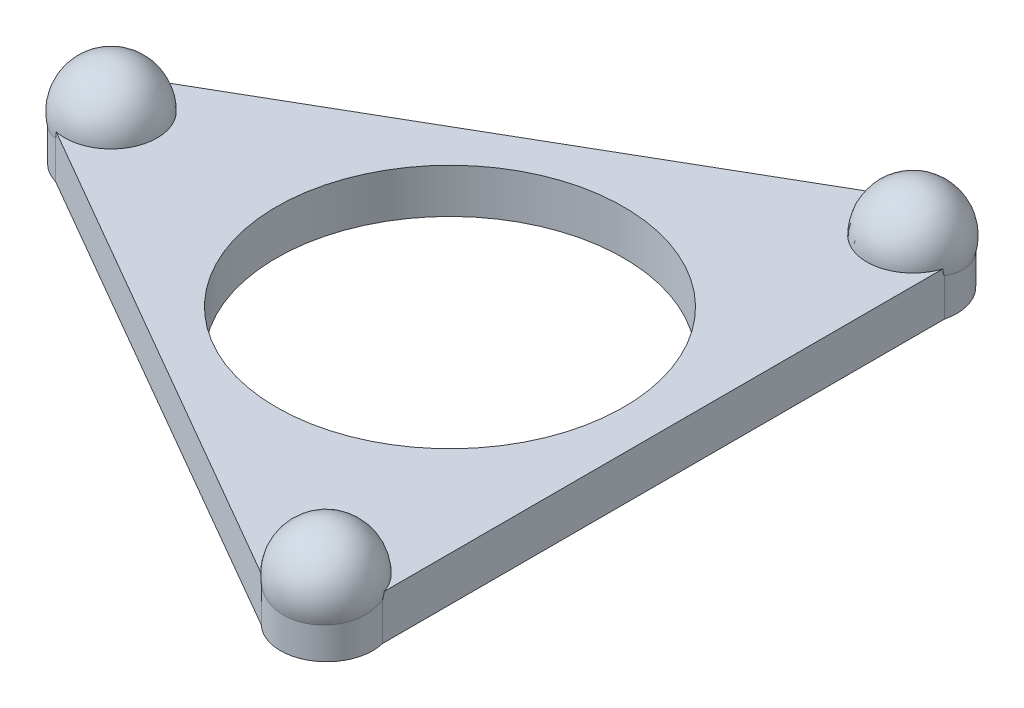
ISO-10303-21;
HEADER;
FILE_DESCRIPTION(('STEP AP214'),'2;1');
FILE_NAME('part.step','',(''),(''),'','','');
FILE_SCHEMA(('AUTOMOTIVE_DESIGN { 1 0 10303 214 1 1 1 1 }'));
ENDSEC;
DATA;
#1=APPLICATION_CONTEXT('core data for automotive mechanical design processes');
#2=APPLICATION_PROTOCOL_DEFINITION('international standard','automotive_design',2000,#1);
#3=PRODUCT_CONTEXT('',#1,'mechanical');
#4=PRODUCT('Part','Part','',(#3));
#5=PRODUCT_RELATED_PRODUCT_CATEGORY('part','',(#4));
#6=PRODUCT_DEFINITION_FORMATION('','',#4);
#7=PRODUCT_DEFINITION_CONTEXT('part definition',#1,'design');
#8=PRODUCT_DEFINITION('design','',#6,#7);
#9=PRODUCT_DEFINITION_SHAPE('','',#8);
#10=(LENGTH_UNIT() NAMED_UNIT(*) SI_UNIT(.MILLI.,.METRE.));
#11=(NAMED_UNIT(*) PLANE_ANGLE_UNIT() SI_UNIT($,.RADIAN.));
#12=(NAMED_UNIT(*) SI_UNIT($,.STERADIAN.) SOLID_ANGLE_UNIT());
#13=UNCERTAINTY_MEASURE_WITH_UNIT(LENGTH_MEASURE(1.E-05),#10,'distance_accuracy_value','');
#14=(GEOMETRIC_REPRESENTATION_CONTEXT(3) GLOBAL_UNCERTAINTY_ASSIGNED_CONTEXT((#13)) GLOBAL_UNIT_ASSIGNED_CONTEXT((#10,
#11,#12)) REPRESENTATION_CONTEXT('',''));
#15=CARTESIAN_POINT('',(0.,0.,0.));
#16=DIRECTION('',(0.,0.,1.));
#17=DIRECTION('',(1.,0.,0.));
#18=AXIS2_PLACEMENT_3D('',#15,#16,#17);
#19=CARTESIAN_POINT('',(0.,1.524,0.));
#20=DIRECTION('',(0.,-1.,0.));
#21=DIRECTION('',(0.,0.,-1.));
#22=AXIS2_PLACEMENT_3D('',#19,#20,#21);
#23=CYLINDRICAL_SURFACE('',#22,5.969);
#24=CARTESIAN_POINT('',(0.,1.524,0.));
#25=DIRECTION('',(0.,1.,0.));
#26=DIRECTION('',(0.,0.,1.));
#27=AXIS2_PLACEMENT_3D('',#24,#25,#26);
#28=CIRCLE('',#27,5.969);
#29=CARTESIAN_POINT('',(0.,1.524,5.969));
#30=VERTEX_POINT('',#29);
#31=EDGE_CURVE('E278',#30,#30,#28,.T.);
#32=ORIENTED_EDGE('',*,*,#31,.T.);
#33=EDGE_LOOP('',(#32));
#34=FACE_BOUND('',#33,.T.);
#35=CARTESIAN_POINT('',(0.,0.,0.));
#36=DIRECTION('',(0.,1.,0.));
#37=DIRECTION('',(0.,0.,1.));
#38=AXIS2_PLACEMENT_3D('',#35,#36,#37);
#39=CIRCLE('',#38,5.969);
#40=CARTESIAN_POINT('',(0.,0.,5.969));
#41=VERTEX_POINT('',#40);
#42=EDGE_CURVE('E267',#41,#41,#39,.T.);
#43=ORIENTED_EDGE('',*,*,#42,.F.);
#44=EDGE_LOOP('',(#43));
#45=FACE_BOUND('',#44,.T.);
#46=ADVANCED_FACE('F99',(#34,#45),#23,.F.);
#47=CARTESIAN_POINT('',(7.33707271536686,1.524,0.));
#48=DIRECTION('',(1.,0.,0.));
#49=DIRECTION('',(0.,0.,-1.));
#50=AXIS2_PLACEMENT_3D('',#47,#48,#49);
#51=PLANE('',#50);
#52=CARTESIAN_POINT('',(7.33707271536686,1.524,-10.0911023878305));
#53=DIRECTION('',(1.,0.,0.));
#54=DIRECTION('',(0.,0.,-1.));
#55=AXIS2_PLACEMENT_3D('',#52,#53,#54);
#56=CIRCLE('',#55,0.486949441360857);
#57=CARTESIAN_POINT('',(7.33707271536686,1.524,-9.60415294646964));
#58=VERTEX_POINT('',#57);
#59=CARTESIAN_POINT('',(7.33707271536686,1.2972225762877,-9.66018272184493));
#60=VERTEX_POINT('',#59);
#61=EDGE_CURVE('E120',#58,#60,#56,.T.);
#62=ORIENTED_EDGE('',*,*,#61,.F.);
#63=DIRECTION('',(0.,0.,1.));
#64=VECTOR('',#63,1.);
#65=CARTESIAN_POINT('',(7.33707271536686,1.524,0.));
#66=LINE('',#65,#64);
#67=CARTESIAN_POINT('',(7.33707271536686,1.524,9.60415294646898));
#68=VERTEX_POINT('',#67);
#69=EDGE_CURVE('E258',#58,#68,#66,.T.);
#70=ORIENTED_EDGE('',*,*,#69,.T.);
#71=CARTESIAN_POINT('',(7.33707271536686,1.524,10.0911023878304));
#72=DIRECTION('',(1.,0.,0.));
#73=DIRECTION('',(0.,0.,-1.));
#74=AXIS2_PLACEMENT_3D('',#71,#72,#73);
#75=CIRCLE('',#74,0.486949441361417);
#76=CARTESIAN_POINT('',(7.33707271536798,1.29722257629052,9.6601827218432));
#77=VERTEX_POINT('',#76);
#78=EDGE_CURVE('E303',#77,#68,#75,.T.);
#79=ORIENTED_EDGE('',*,*,#78,.F.);
#80=DIRECTION('',(0.,-1.,0.));
#81=VECTOR('',#80,1.);
#82=CARTESIAN_POINT('',(7.33707271536686,1.524,9.66018272184347));
#83=LINE('',#82,#81);
#84=CARTESIAN_POINT('',(7.33707271536686,0.,9.66018272184347));
#85=VERTEX_POINT('',#84);
#86=EDGE_CURVE('E195',#77,#85,#83,.T.);
#87=ORIENTED_EDGE('',*,*,#86,.T.);
#88=DIRECTION('',(0.,0.,1.));
#89=VECTOR('',#88,1.);
#90=CARTESIAN_POINT('',(7.33707271536686,0.,0.));
#91=LINE('',#90,#89);
#92=CARTESIAN_POINT('',(7.33707271536686,0.,-9.66018272184493));
#93=VERTEX_POINT('',#92);
#94=EDGE_CURVE('E206',#93,#85,#91,.T.);
#95=ORIENTED_EDGE('',*,*,#94,.F.);
#96=DIRECTION('',(0.,-1.,0.));
#97=VECTOR('',#96,1.);
#98=CARTESIAN_POINT('',(7.33707271536686,1.524,-9.66018272184493));
#99=LINE('',#98,#97);
#100=EDGE_CURVE('E192',#60,#93,#99,.T.);
#101=ORIENTED_EDGE('',*,*,#100,.F.);
#102=EDGE_LOOP('',(#62,#70,#79,#87,#95,#101));
#103=FACE_BOUND('',#102,.T.);
#104=ADVANCED_FACE('F246',(#103),#51,.T.);
#105=CARTESIAN_POINT('',(-3.66853635768374,1.524,-6.35409136092192));
#106=DIRECTION('',(-0.5,0.,-0.866025403784439));
#107=DIRECTION('',(-0.866025403784439,0.,0.5));
#108=AXIS2_PLACEMENT_3D('',#105,#106,#107);
#109=PLANE('',#108);
#110=CARTESIAN_POINT('',(5.07061466236716,1.524,-11.3996425548371));
#111=DIRECTION('',(-0.5,0.,-0.866025403784439));
#112=DIRECTION('',(-0.866025403784439,0.,0.5));
#113=AXIS2_PLACEMENT_3D('',#110,#111,#112);
#114=CIRCLE('',#113,0.48694944135962);
#115=CARTESIAN_POINT('',(4.69742728463154,1.29722257630046,-11.1841827218459));
#116=VERTEX_POINT('',#115);
#117=CARTESIAN_POINT('',(4.64890407579109,1.524,-11.1561678341573));
#118=VERTEX_POINT('',#117);
#119=EDGE_CURVE('E174',#116,#118,#114,.T.);
#120=ORIENTED_EDGE('',*,*,#119,.F.);
#121=DIRECTION('',(0.,-1.,0.));
#122=VECTOR('',#121,1.);
#123=CARTESIAN_POINT('',(4.69742728463315,1.524,-11.1841827218442));
#124=LINE('',#123,#122);
#125=CARTESIAN_POINT('',(4.69742728463315,0.,-11.1841827218442));
#126=VERTEX_POINT('',#125);
#127=EDGE_CURVE('E183',#116,#126,#124,.T.);
#128=ORIENTED_EDGE('',*,*,#127,.T.);
#129=DIRECTION('',(0.866025403784439,0.,-0.5));
#130=VECTOR('',#129,1.);
#131=CARTESIAN_POINT('',(-3.66853635768374,0.,-6.35409136092192));
#132=LINE('',#131,#130);
#133=CARTESIAN_POINT('',(-12.0345,0.,-1.524));
#134=VERTEX_POINT('',#133);
#135=EDGE_CURVE('E284',#134,#126,#132,.T.);
#136=ORIENTED_EDGE('',*,*,#135,.F.);
#137=DIRECTION('',(0.,-1.,0.));
#138=VECTOR('',#137,1.);
#139=CARTESIAN_POINT('',(-12.0345,1.524,-1.524));
#140=LINE('',#139,#138);
#141=CARTESIAN_POINT('',(-12.0345,1.29722257628673,-1.524));
#142=VERTEX_POINT('',#141);
#143=EDGE_CURVE('E193',#142,#134,#140,.T.);
#144=ORIENTED_EDGE('',*,*,#143,.F.);
#145=CARTESIAN_POINT('',(-12.4076873777347,1.524,-1.30854016700669));
#146=DIRECTION('',(-0.5,0.,-0.866025403784439));
#147=DIRECTION('',(-0.866025403784439,0.,0.5));
#148=AXIS2_PLACEMENT_3D('',#145,#146,#147);
#149=CIRCLE('',#148,0.486949441359203);
#150=CARTESIAN_POINT('',(-11.985976791159,1.524,-1.55201488768629));
#151=VERTEX_POINT('',#150);
#152=EDGE_CURVE('E308',#151,#142,#149,.T.);
#153=ORIENTED_EDGE('',*,*,#152,.F.);
#154=DIRECTION('',(0.866025403784439,0.,-0.5));
#155=VECTOR('',#154,1.);
#156=CARTESIAN_POINT('',(-3.66853635768374,1.524,-6.35409136092192));
#157=LINE('',#156,#155);
#158=EDGE_CURVE('E187',#151,#118,#157,.T.);
#159=ORIENTED_EDGE('',*,*,#158,.T.);
#160=EDGE_LOOP('',(#120,#128,#136,#144,#153,#159));
#161=FACE_BOUND('',#160,.T.);
#162=ADVANCED_FACE('F181',(#161),#109,.T.);
#163=CARTESIAN_POINT('',(-3.66853635768311,1.524,6.35409136092082));
#164=DIRECTION('',(-0.5,0.,0.866025403784439));
#165=DIRECTION('',(0.866025403784439,0.,0.5));
#166=AXIS2_PLACEMENT_3D('',#163,#164,#165);
#167=PLANE('',#166);
#168=CARTESIAN_POINT('',(5.07061466236789,1.524,11.3996425548361));
#169=DIRECTION('',(-0.5,0.,0.866025403784439));
#170=DIRECTION('',(0.866025403784439,0.,0.5));
#171=AXIS2_PLACEMENT_3D('',#168,#169,#170);
#172=CIRCLE('',#171,0.486949441362978);
#173=CARTESIAN_POINT('',(4.64890407578891,1.524,11.1561678341546));
#174=VERTEX_POINT('',#173);
#175=CARTESIAN_POINT('',(4.69742728463316,1.29722257627696,11.1841827218427));
#176=VERTEX_POINT('',#175);
#177=EDGE_CURVE('E127',#174,#176,#172,.T.);
#178=ORIENTED_EDGE('',*,*,#177,.F.);
#179=DIRECTION('',(-0.866025403784439,0.,-0.5));
#180=VECTOR('',#179,1.);
#181=CARTESIAN_POINT('',(-3.66853635768311,1.524,6.35409136092082));
#182=LINE('',#181,#180);
#183=CARTESIAN_POINT('',(-11.9859767911549,1.524,1.55201488768724));
#184=VERTEX_POINT('',#183);
#185=EDGE_CURVE('E269',#174,#184,#182,.T.);
#186=ORIENTED_EDGE('',*,*,#185,.T.);
#187=CARTESIAN_POINT('',(-12.4076873777341,1.524,1.30854016700562));
#188=DIRECTION('',(-0.5,0.,0.866025403784439));
#189=DIRECTION('',(0.866025403784439,0.,0.5));
#190=AXIS2_PLACEMENT_3D('',#187,#188,#189);
#191=CIRCLE('',#190,0.486949441363247);
#192=CARTESIAN_POINT('',(-12.0345000000004,1.29722257628629,1.52399999999989));
#193=VERTEX_POINT('',#192);
#194=EDGE_CURVE('E293',#193,#184,#191,.T.);
#195=ORIENTED_EDGE('',*,*,#194,.F.);
#196=DIRECTION('',(0.,-1.,0.));
#197=VECTOR('',#196,1.);
#198=CARTESIAN_POINT('',(-12.0345,1.524,1.52399999999854));
#199=LINE('',#198,#197);
#200=CARTESIAN_POINT('',(-12.0345,0.,1.52399999999854));
#201=VERTEX_POINT('',#200);
#202=EDGE_CURVE('E197',#193,#201,#199,.T.);
#203=ORIENTED_EDGE('',*,*,#202,.T.);
#204=DIRECTION('',(-0.866025403784439,0.,-0.5));
#205=VECTOR('',#204,1.);
#206=CARTESIAN_POINT('',(-3.66853635768311,0.,6.35409136092082));
#207=LINE('',#206,#205);
#208=CARTESIAN_POINT('',(4.69742728463316,0.,11.1841827218427));
#209=VERTEX_POINT('',#208);
#210=EDGE_CURVE('E272',#209,#201,#207,.T.);
#211=ORIENTED_EDGE('',*,*,#210,.F.);
#212=DIRECTION('',(0.,-1.,0.));
#213=VECTOR('',#212,1.);
#214=CARTESIAN_POINT('',(4.69742728463316,1.524,11.1841827218427));
#215=LINE('',#214,#213);
#216=EDGE_CURVE('E281',#176,#209,#215,.T.);
#217=ORIENTED_EDGE('',*,*,#216,.F.);
#218=EDGE_LOOP('',(#178,#186,#195,#203,#211,#217));
#219=FACE_BOUND('',#218,.T.);
#220=ADVANCED_FACE('F242',(#219),#167,.T.);
#221=CARTESIAN_POINT('',(0.,0.,0.));
#222=DIRECTION('',(0.,1.,0.));
#223=DIRECTION('',(0.,0.,1.));
#224=AXIS2_PLACEMENT_3D('',#221,#222,#223);
#225=PLANE('',#224);
#226=CARTESIAN_POINT('',(5.82610068003386,0.,-10.0911023878305));
#227=DIRECTION('',(0.,1.,0.));
#228=DIRECTION('',(0.,0.,1.));
#229=AXIS2_PLACEMENT_3D('',#226,#227,#228);
#230=CIRCLE('',#229,0.444500000000002);
#231=CARTESIAN_POINT('',(5.82610068003386,0.,-9.64660238783049));
#232=VERTEX_POINT('',#231);
#233=EDGE_CURVE('E304',#232,#232,#230,.T.);
#234=ORIENTED_EDGE('',*,*,#233,.T.);
#235=EDGE_LOOP('',(#234));
#236=FACE_BOUND('',#235,.T.);
#237=CARTESIAN_POINT('',(5.82610068003404,0.,10.0911023878304));
#238=DIRECTION('',(0.,1.,0.));
#239=DIRECTION('',(0.,0.,1.));
#240=AXIS2_PLACEMENT_3D('',#237,#238,#239);
#241=CIRCLE('',#240,0.444500000000002);
#242=CARTESIAN_POINT('',(5.82610068003404,0.,10.5356023878304));
#243=VERTEX_POINT('',#242);
#244=EDGE_CURVE('E313',#243,#243,#241,.T.);
#245=ORIENTED_EDGE('',*,*,#244,.T.);
#246=EDGE_LOOP('',(#245));
#247=FACE_BOUND('',#246,.T.);
#248=CARTESIAN_POINT('',(-11.6522013600679,0.,0.));
#249=DIRECTION('',(0.,1.,0.));
#250=DIRECTION('',(0.,0.,1.));
#251=AXIS2_PLACEMENT_3D('',#248,#249,#250);
#252=CIRCLE('',#251,0.444500000000002);
#253=CARTESIAN_POINT('',(-11.6522013600679,0.,0.444500000000028));
#254=VERTEX_POINT('',#253);
#255=EDGE_CURVE('E211',#254,#254,#252,.T.);
#256=ORIENTED_EDGE('',*,*,#255,.T.);
#257=EDGE_LOOP('',(#256));
#258=FACE_BOUND('',#257,.T.);
#259=ORIENTED_EDGE('',*,*,#94,.T.);
#260=CARTESIAN_POINT('',(5.79500000000064,0.,10.0372344298606));
#261=DIRECTION('',(0.,1.,0.));
#262=DIRECTION('',(0.,0.,1.));
#263=AXIS2_PLACEMENT_3D('',#260,#261,#262);
#264=CIRCLE('',#263,1.58749999999975);
#265=EDGE_CURVE('E207',#209,#85,#264,.T.);
#266=ORIENTED_EDGE('',*,*,#265,.F.);
#267=ORIENTED_EDGE('',*,*,#210,.T.);
#268=CARTESIAN_POINT('',(-11.59,0.,0.));
#269=DIRECTION('',(0.,1.,0.));
#270=DIRECTION('',(0.,0.,1.));
#271=AXIS2_PLACEMENT_3D('',#268,#269,#270);
#272=CIRCLE('',#271,1.5875);
#273=EDGE_CURVE('E203',#134,#201,#272,.T.);
#274=ORIENTED_EDGE('',*,*,#273,.F.);
#275=ORIENTED_EDGE('',*,*,#135,.T.);
#276=CARTESIAN_POINT('',(5.79499999999937,0.,-10.0372344298627));
#277=DIRECTION('',(0.,1.,0.));
#278=DIRECTION('',(0.,0.,1.));
#279=AXIS2_PLACEMENT_3D('',#276,#277,#278);
#280=CIRCLE('',#279,1.58750000000094);
#281=EDGE_CURVE('E190',#93,#126,#280,.T.);
#282=ORIENTED_EDGE('',*,*,#281,.F.);
#283=EDGE_LOOP('',(#259,#266,#267,#274,#275,#282));
#284=FACE_BOUND('',#283,.T.);
#285=ORIENTED_EDGE('',*,*,#42,.T.);
#286=EDGE_LOOP('',(#285));
#287=FACE_BOUND('',#286,.T.);
#288=ADVANCED_FACE('F238',(#236,#247,#258,#284,#287),#225,.F.);
#289=CARTESIAN_POINT('',(0.,1.524,0.));
#290=DIRECTION('',(0.,1.,0.));
#291=DIRECTION('',(0.,0.,1.));
#292=AXIS2_PLACEMENT_3D('',#289,#290,#291);
#293=PLANE('',#292);
#294=CARTESIAN_POINT('',(5.82610068003386,1.524,-10.0911023878305));
#295=DIRECTION('',(0.,1.,0.));
#296=DIRECTION('',(0.,0.,1.));
#297=AXIS2_PLACEMENT_3D('',#294,#295,#296);
#298=CIRCLE('',#297,1.5875);
#299=EDGE_CURVE('E261',#118,#58,#298,.T.);
#300=ORIENTED_EDGE('',*,*,#299,.F.);
#301=ORIENTED_EDGE('',*,*,#158,.F.);
#302=CARTESIAN_POINT('',(-11.6522013600679,1.524,0.));
#303=DIRECTION('',(0.,1.,0.));
#304=DIRECTION('',(0.,0.,1.));
#305=AXIS2_PLACEMENT_3D('',#302,#303,#304);
#306=CIRCLE('',#305,1.5875);
#307=EDGE_CURVE('E307',#184,#151,#306,.T.);
#308=ORIENTED_EDGE('',*,*,#307,.F.);
#309=ORIENTED_EDGE('',*,*,#185,.F.);
#310=CARTESIAN_POINT('',(5.82610068003404,1.524,10.0911023878304));
#311=DIRECTION('',(0.,1.,0.));
#312=DIRECTION('',(0.,0.,1.));
#313=AXIS2_PLACEMENT_3D('',#310,#311,#312);
#314=CIRCLE('',#313,1.5875);
#315=EDGE_CURVE('E266',#68,#174,#314,.T.);
#316=ORIENTED_EDGE('',*,*,#315,.F.);
#317=ORIENTED_EDGE('',*,*,#69,.F.);
#318=EDGE_LOOP('',(#300,#301,#308,#309,#316,#317));
#319=FACE_BOUND('',#318,.T.);
#320=ORIENTED_EDGE('',*,*,#31,.F.);
#321=EDGE_LOOP('',(#320));
#322=FACE_BOUND('',#321,.T.);
#323=ADVANCED_FACE('F235',(#319,#322),#293,.T.);
#324=CARTESIAN_POINT('',(5.79499999999937,1.524,-10.0372344298627));
#325=DIRECTION('',(0.,-1.,0.));
#326=DIRECTION('',(0.,0.,-1.));
#327=AXIS2_PLACEMENT_3D('',#324,#325,#326);
#328=CYLINDRICAL_SURFACE('',#327,1.58750000000094);
#329=ORIENTED_EDGE('',*,*,#127,.F.);
#330=CARTESIAN_POINT('',(4.6972272846337,1.2972954865,-11.1839912983408));
#331=CARTESIAN_POINT('',(4.72828684871941,1.28600952431025,-11.2137383548562));
#332=CARTESIAN_POINT('',(4.7607200011554,1.27556049728358,-11.2423529276116));
#333=CARTESIAN_POINT('',(4.82805595520429,1.25602633440648,-11.2970149829129));
#334=CARTESIAN_POINT('',(4.86295826810045,1.24694092976167,-11.3230629710299));
#335=CARTESIAN_POINT('',(4.93494047852183,1.22982624599365,-11.3722832410199));
#336=CARTESIAN_POINT('',(4.97201872270494,1.22179617964323,-11.3954576656833));
#337=CARTESIAN_POINT('',(5.048089862231,1.20663333934035,-11.4387332715846));
#338=CARTESIAN_POINT('',(5.08708280628538,1.19950058823273,-11.4588343745813));
#339=CARTESIAN_POINT('',(5.2065173256393,1.17927503799786,-11.5142335428927));
#340=CARTESIAN_POINT('',(5.28948337011051,1.16733930064697,-11.5446745637371));
#341=CARTESIAN_POINT('',(5.45956543899067,1.14608802216454,-11.5913994451811));
#342=CARTESIAN_POINT('',(5.5466806004971,1.13677193897529,-11.6076862360284));
#343=CARTESIAN_POINT('',(5.72296303915873,1.12046736291856,-11.6255793678842));
#344=CARTESIAN_POINT('',(5.81213670666996,1.11348759288227,-11.6271312719604));
#345=CARTESIAN_POINT('',(5.98964540812091,1.10176413856207,-11.6152664595577));
#346=CARTESIAN_POINT('',(6.07798029854064,1.09702083042802,-11.6018472263644));
#347=CARTESIAN_POINT('',(6.25078225440795,1.08971612070076,-11.5604777037266));
#348=CARTESIAN_POINT('',(6.33526717760014,1.08714340470052,-11.5326040043113));
#349=CARTESIAN_POINT('',(6.49842704660815,1.08410380075378,-11.4631402064883));
#350=CARTESIAN_POINT('',(6.57710263953422,1.08363667791287,-11.4215516386305));
#351=CARTESIAN_POINT('',(6.72618258319152,1.08480001512947,-11.3259826546642));
#352=CARTESIAN_POINT('',(6.79661054709689,1.08642431883293,-11.2720389908435));
#353=CARTESIAN_POINT('',(6.92747726491951,1.09178086790663,-11.1532370091248));
#354=CARTESIAN_POINT('',(6.98791549724446,1.09551322329933,-11.0883781216685));
#355=CARTESIAN_POINT('',(7.0971308470594,1.10514064937642,-10.949600030287));
#356=CARTESIAN_POINT('',(7.14590427705696,1.11103640246816,-10.8756779724417));
#357=CARTESIAN_POINT('',(7.23043900160612,1.12509453756356,-10.7209328430544));
#358=CARTESIAN_POINT('',(7.2662003234585,1.13325691481153,-10.6401097859919));
#359=CARTESIAN_POINT('',(7.32389774730222,1.15206816659397,-10.4736072073825));
#360=CARTESIAN_POINT('',(7.34578138030083,1.16272627162144,-10.3879105740256));
#361=CARTESIAN_POINT('',(7.37502219299717,1.18687899482449,-10.2144730410857));
#362=CARTESIAN_POINT('',(7.38238431265514,1.20037264666847,-10.1267328469664));
#363=CARTESIAN_POINT('',(7.38258278910666,1.22683921600792,-9.97496760915603));
#364=CARTESIAN_POINT('',(7.37873665218775,1.23901174875407,-9.91078802771584));
#365=CARTESIAN_POINT('',(7.36347604579343,1.26598648458387,-9.78397034621684));
#366=CARTESIAN_POINT('',(7.35206917948411,1.28078603496903,-9.72133076307737));
#367=CARTESIAN_POINT('',(7.33702379968639,1.29727679849517,-9.65998272184568));
#368=B_SPLINE_CURVE_WITH_KNOTS('',3,(#330,#331,#332,#333,#334,#335,#336,#337,#338,#339,#340,
#341,#342,#343,#344,#345,#346,#347,#348,#349,#350,#351,#352,#353,#354,#355,#356,#357,#358,#359,
#360,#361,#362,#363,#364,#365,#366,#367),.UNSPECIFIED.,.F.,.F.,(4,2,2,2,2,2,2,2,2,2,2,2,2,2,2,2,
2,2,4),(0.,0.133330345661754,0.266634374911032,0.399838394987605,0.533045805632503,
0.799209355971243,1.06531779126667,1.33240896335372,1.59954504141483,1.86527989104834,
2.13098509527197,2.39590995090336,2.66084863464805,2.92587096077617,3.19089273085613,
3.45691061775032,3.72283799447836,3.9186651212725,4.11429561997101),.UNSPECIFIED.);
#369=EDGE_CURVE('E12',#116,#60,#368,.T.);
#370=ORIENTED_EDGE('',*,*,#369,.T.);
#371=ORIENTED_EDGE('',*,*,#100,.T.);
#372=ORIENTED_EDGE('',*,*,#281,.T.);
#373=EDGE_LOOP('',(#329,#370,#371,#372));
#374=FACE_BOUND('',#373,.T.);
#375=ADVANCED_FACE('F101',(#374),#328,.T.);
#376=CARTESIAN_POINT('',(5.79500000000064,1.524,10.0372344298606));
#377=DIRECTION('',(0.,-1.,0.));
#378=DIRECTION('',(0.,0.,-1.));
#379=AXIS2_PLACEMENT_3D('',#376,#377,#378);
#380=CYLINDRICAL_SURFACE('',#379,1.58749999999975);
#381=ORIENTED_EDGE('',*,*,#86,.F.);
#382=CARTESIAN_POINT('',(7.33702379968662,1.29727679849799,9.65998272184423));
#383=CARTESIAN_POINT('',(7.34725395109121,1.28599179315436,9.70175547051591));
#384=CARTESIAN_POINT('',(7.35581648008409,1.27554357898766,9.74415142008034));
#385=CARTESIAN_POINT('',(7.36948344719003,1.25601084477519,9.82979833961158));
#386=CARTESIAN_POINT('',(7.37458856720831,1.24692605609613,9.87304913924331));
#387=CARTESIAN_POINT('',(7.3812195147472,1.22981249874252,9.95999853975966));
#388=CARTESIAN_POINT('',(7.3827480242088,1.221782943063,10.0036967804155));
#389=CARTESIAN_POINT('',(7.38218616476758,1.20662105530805,10.0912145846407));
#390=CARTESIAN_POINT('',(7.38009570383567,1.19948874605423,10.135034151267));
#391=CARTESIAN_POINT('',(7.36834932573163,1.17926445084472,10.2661672185669));
#392=CARTESIAN_POINT('',(7.35322480242252,1.16732946334142,10.3532381692435));
#393=CARTESIAN_POINT('',(7.30864033893045,1.1460796078996,10.5238947225407));
#394=CARTESIAN_POINT('',(7.27918336855618,1.13676419779241,10.6074810433134));
#395=CARTESIAN_POINT('',(7.20653004858033,1.12046097279708,10.7690895306725));
#396=CARTESIAN_POINT('',(7.16328342351608,1.11348186971905,10.8470900373556));
#397=CARTESIAN_POINT('',(7.06424669847627,1.10175971712787,10.9948798425797));
#398=CARTESIAN_POINT('',(7.00845449082804,1.09701704375267,11.0646677583913));
#399=CARTESIAN_POINT('',(6.88622025565593,1.08971358210253,11.193627910818));
#400=CARTESIAN_POINT('',(6.81983562501085,1.08714147960373,11.2528539100833));
#401=CARTESIAN_POINT('',(6.67809319872928,1.08410309431434,11.3594156911573));
#402=CARTESIAN_POINT('',(6.60273640494373,1.08363657663555,11.4067527986733));
#403=CARTESIAN_POINT('',(6.44542741426866,1.08480112201034,11.4880676956611));
#404=CARTESIAN_POINT('',(6.36349523419209,1.08642602965767,11.5220843058518));
#405=CARTESIAN_POINT('',(6.19517380947224,1.09178379605008,11.5760090814608));
#406=CARTESIAN_POINT('',(6.10878433241045,1.09551676481773,11.5959165103795));
#407=CARTESIAN_POINT('',(5.93399015263196,1.10514544065018,11.6211023118063));
#408=CARTESIAN_POINT('',(5.84558482137688,1.11104183115712,11.6263760569042));
#409=CARTESIAN_POINT('',(5.66930449983788,1.12510128239466,11.6222042353272));
#410=CARTESIAN_POINT('',(5.58142950845159,1.13326433841211,11.6127586992584));
#411=CARTESIAN_POINT('',(5.40838699058194,1.15207702798143,11.5794665464972));
#412=CARTESIAN_POINT('',(5.32323088340601,1.16273589342524,11.5555659284767));
#413=CARTESIAN_POINT('',(5.15841220566485,1.1868902844879,11.4941625773116));
#414=CARTESIAN_POINT('',(5.07874777548487,1.20038484354353,11.456664475799));
#415=CARTESIAN_POINT('',(4.94722035376466,1.22685312514458,11.3809478826406));
#416=CARTESIAN_POINT('',(4.8935645844831,1.23902637761323,11.3455251310433));
#417=CARTESIAN_POINT('',(4.7913724049696,1.26600286291804,11.2688964589787));
#418=CARTESIAN_POINT('',(4.74283090904829,1.28080344301551,11.2276963804481));
#419=CARTESIAN_POINT('',(4.6972272846337,1.29729548647713,11.1839912983358));
#420=B_SPLINE_CURVE_WITH_KNOTS('',3,(#382,#383,#384,#385,#386,#387,#388,#389,#390,#391,#392,
#393,#394,#395,#396,#397,#398,#399,#400,#401,#402,#403,#404,#405,#406,#407,#408,#409,#410,#411,
#412,#413,#414,#415,#416,#417,#418,#419),.UNSPECIFIED.,.F.,.F.,(4,2,2,2,2,2,2,2,2,2,2,2,2,2,2,2,
2,2,4),(0.,0.13333079428035,0.266635284046312,0.399839782634195,0.533047668613115,
0.799212269249703,1.06532174171973,1.33241272995993,1.59954862337051,1.86528330036753,
2.13098833264078,2.3959131368987,2.66085176921893,2.9258741699256,3.19089601956644,
3.45691410728056,3.72284166778388,3.91866694497672,4.11429561598447),.UNSPECIFIED.);
#421=EDGE_CURVE('E113',#77,#176,#420,.T.);
#422=ORIENTED_EDGE('',*,*,#421,.T.);
#423=ORIENTED_EDGE('',*,*,#216,.T.);
#424=ORIENTED_EDGE('',*,*,#265,.T.);
#425=EDGE_LOOP('',(#381,#422,#423,#424));
#426=FACE_BOUND('',#425,.T.);
#427=ADVANCED_FACE('F302',(#426),#380,.T.);
#428=CARTESIAN_POINT('',(-11.59,1.524,0.));
#429=DIRECTION('',(0.,-1.,0.));
#430=DIRECTION('',(0.,0.,-1.));
#431=AXIS2_PLACEMENT_3D('',#428,#429,#430);
#432=CYLINDRICAL_SURFACE('',#431,1.5875);
#433=ORIENTED_EDGE('',*,*,#202,.F.);
#434=CARTESIAN_POINT('',(-12.0343000000007,1.29727743967077,1.52405831909391));
#435=CARTESIAN_POINT('',(-12.0755913424378,1.2859924015001,1.51203158301072));
#436=CARTESIAN_POINT('',(-12.1165885862038,1.27554415944583,1.49824904309254));
#437=CARTESIAN_POINT('',(-12.1975945057584,1.25601137621827,1.4672616578427));
#438=CARTESIAN_POINT('',(-12.2376033749864,1.24692656640616,1.45005748823654));
#439=CARTESIAN_POINT('',(-12.3162192812035,1.22981297040589,1.41232548886639));
#440=CARTESIAN_POINT('',(-12.354827347197,1.22178339720518,1.39180016186236));
#441=CARTESIAN_POINT('',(-12.4303391152169,1.20662147676806,1.34755480387175));
#442=CARTESIAN_POINT('',(-12.4672427738748,1.19948915235405,1.32383469165448));
#443=CARTESIAN_POINT('',(-12.5749342542303,1.17926481408532,1.24809568321669));
#444=CARTESIAN_POINT('',(-12.6427777276031,1.16732980085528,1.19146210673181));
#445=CARTESIAN_POINT('',(-12.7682785878518,1.14607989658814,1.06752277862966));
#446=CARTESIAN_POINT('',(-12.825938081547,1.13676446338652,1.00021923984972));
#447=CARTESIAN_POINT('',(-12.9295687080414,1.12046119203203,0.856495559268119));
#448=CARTESIAN_POINT('',(-12.9754959432659,1.1134820660682,0.780042706118762));
#449=CARTESIAN_POINT('',(-13.0539675726806,1.10175986881682,0.620379613098404));
#450=CARTESIAN_POINT('',(-13.0865097155683,1.09701717366562,0.537168239295658));
#451=CARTESIAN_POINT('',(-13.1370756497363,1.08971366920458,0.366830292241528));
#452=CARTESIAN_POINT('',(-13.1551746992868,1.08714154566062,0.27972654496287));
#453=CARTESIAN_POINT('',(-13.1765889881772,1.08410311854763,0.103693144798798));
#454=CARTESIAN_POINT('',(-13.1799058764715,1.0836365800999,0.0147636966826919));
#455=CARTESIAN_POINT('',(-13.1716724403535,1.08480108403623,-0.162127351533027));
#456=CARTESIAN_POINT('',(-13.1601657441986,1.08642597099747,-0.250091026855501));
#457=CARTESIAN_POINT('',(-13.122705542248,1.09178369564278,-0.42282410876859));
#458=CARTESIAN_POINT('',(-13.0967512827039,1.0955166433073,-0.507593348454893));
#459=CARTESIAN_POINT('',(-13.0311660083846,1.10514527611167,-0.671562555484786));
#460=CARTESIAN_POINT('',(-12.9915306724962,1.11104164459643,-0.750760753711976));
#461=CARTESIAN_POINT('',(-12.8997778561224,1.12510105018284,-0.901338233244621));
#462=CARTESIAN_POINT('',(-12.8476604006373,1.1332640827446,-0.972717530210071));
#463=CARTESIAN_POINT('',(-12.732307501905,1.15207672581751,-1.10593087302785));
#464=CARTESIAN_POINT('',(-12.6690310008353,1.16273556842214,-1.1677280280594));
#465=CARTESIAN_POINT('',(-12.5334449709442,1.18688989859881,-1.27976373844536));
#466=CARTESIAN_POINT('',(-12.4611385258841,1.20038441884472,-1.33000622319969));
#467=CARTESIAN_POINT('',(-12.3298121420452,1.22685070246282,-1.40604862631501));
#468=CARTESIAN_POINT('',(-12.2723176154419,1.23902166287595,-1.43480021694241));
#469=CARTESIAN_POINT('',(-12.1548805348102,1.26599244102483,-1.48498089135251));
#470=CARTESIAN_POINT('',(-12.0949404983583,1.28078960525481,-1.50641730305504));
#471=CARTESIAN_POINT('',(-12.0343000000007,1.29727743967109,-1.52405831909391));
#472=B_SPLINE_CURVE_WITH_KNOTS('',3,(#434,#435,#436,#437,#438,#439,#440,#441,#442,#443,#444,
#445,#446,#447,#448,#449,#450,#451,#452,#453,#454,#455,#456,#457,#458,#459,#460,#461,#462,#463,
#464,#465,#466,#467,#468,#469,#470,#471),.UNSPECIFIED.,.F.,.F.,(4,2,2,2,2,2,2,2,2,2,2,2,2,2,2,2,
2,2,4),(0.,0.133330778889179,0.266635252855867,0.399839735035189,0.533047604714527,
0.799212169307864,1.06532160622217,1.3324126008917,1.59954850051714,1.86528318282361,
2.13098822160981,2.39591303027555,2.66085166171443,2.92587404964708,3.19089590677297,
3.45691402381789,3.72284154179418,3.91863283663419,4.1142274194295),.UNSPECIFIED.);
#473=EDGE_CURVE('E202',#193,#142,#472,.T.);
#474=ORIENTED_EDGE('',*,*,#473,.T.);
#475=ORIENTED_EDGE('',*,*,#143,.T.);
#476=ORIENTED_EDGE('',*,*,#273,.T.);
#477=EDGE_LOOP('',(#433,#474,#475,#476));
#478=FACE_BOUND('',#477,.T.);
#479=ADVANCED_FACE('F224',(#478),#432,.T.);
#480=CARTESIAN_POINT('',(-11.6522013600679,1.524,0.));
#481=DIRECTION('',(0.,0.,1.));
#482=DIRECTION('',(-1.,0.,0.));
#483=AXIS2_PLACEMENT_3D('',#480,#481,#482);
#484=SPHERICAL_SURFACE('',#483,1.5875);
#485=ORIENTED_EDGE('',*,*,#194,.T.);
#486=ORIENTED_EDGE('',*,*,#307,.T.);
#487=ORIENTED_EDGE('',*,*,#152,.T.);
#488=ORIENTED_EDGE('',*,*,#473,.F.);
#489=EDGE_LOOP('',(#485,#486,#487,#488));
#490=FACE_BOUND('',#489,.T.);
#491=ADVANCED_FACE('F227',(#490),#484,.T.);
#492=CARTESIAN_POINT('',(-11.6522013600679,1.524,0.));
#493=DIRECTION('',(0.,1.,0.));
#494=DIRECTION('',(0.,0.,1.));
#495=AXIS2_PLACEMENT_3D('',#492,#493,#494);
#496=SPHERICAL_SURFACE('',#495,1.5875);
#497=ORIENTED_EDGE('',*,*,#255,.F.);
#498=EDGE_LOOP('',(#497));
#499=FACE_BOUND('',#498,.T.);
#500=ADVANCED_FACE('F231',(#499),#496,.T.);
#501=CARTESIAN_POINT('',(5.82610068003404,1.524,10.0911023878304));
#502=DIRECTION('',(0.866025403784436,0.,-0.500000000000004));
#503=DIRECTION('',(0.500000000000004,0.,0.866025403784436));
#504=AXIS2_PLACEMENT_3D('',#501,#502,#503);
#505=SPHERICAL_SURFACE('',#504,1.5875);
#506=ORIENTED_EDGE('',*,*,#78,.T.);
#507=ORIENTED_EDGE('',*,*,#315,.T.);
#508=ORIENTED_EDGE('',*,*,#177,.T.);
#509=ORIENTED_EDGE('',*,*,#421,.F.);
#510=EDGE_LOOP('',(#506,#507,#508,#509));
#511=FACE_BOUND('',#510,.T.);
#512=ADVANCED_FACE('F233',(#511),#505,.T.);
#513=CARTESIAN_POINT('',(5.82610068003404,1.524,10.0911023878304));
#514=DIRECTION('',(0.,1.,0.));
#515=DIRECTION('',(0.,0.,1.));
#516=AXIS2_PLACEMENT_3D('',#513,#514,#515);
#517=SPHERICAL_SURFACE('',#516,1.5875);
#518=ORIENTED_EDGE('',*,*,#244,.F.);
#519=EDGE_LOOP('',(#518));
#520=FACE_BOUND('',#519,.T.);
#521=ADVANCED_FACE('F328',(#520),#517,.T.);
#522=CARTESIAN_POINT('',(5.82610068003386,1.524,-10.0911023878305));
#523=DIRECTION('',(-0.866025403784443,0.,-0.499999999999992));
#524=DIRECTION('',(0.499999999999992,0.,-0.866025403784443));
#525=AXIS2_PLACEMENT_3D('',#522,#523,#524);
#526=SPHERICAL_SURFACE('',#525,1.5875);
#527=ORIENTED_EDGE('',*,*,#119,.T.);
#528=ORIENTED_EDGE('',*,*,#299,.T.);
#529=ORIENTED_EDGE('',*,*,#61,.T.);
#530=ORIENTED_EDGE('',*,*,#369,.F.);
#531=EDGE_LOOP('',(#527,#528,#529,#530));
#532=FACE_BOUND('',#531,.T.);
#533=ADVANCED_FACE('F173',(#532),#526,.T.);
#534=CARTESIAN_POINT('',(5.82610068003386,1.524,-10.0911023878305));
#535=DIRECTION('',(0.,1.,0.));
#536=DIRECTION('',(0.,0.,1.));
#537=AXIS2_PLACEMENT_3D('',#534,#535,#536);
#538=SPHERICAL_SURFACE('',#537,1.5875);
#539=ORIENTED_EDGE('',*,*,#233,.F.);
#540=EDGE_LOOP('',(#539));
#541=FACE_BOUND('',#540,.T.);
#542=ADVANCED_FACE('F323',(#541),#538,.T.);
#543=CLOSED_SHELL('',(#46,#104,#162,#220,#288,#323,#375,#427,#479,#491,#500,#512,#521,#533,#542));
#544=MANIFOLD_SOLID_BREP('B2',#543);
#545=ADVANCED_BREP_SHAPE_REPRESENTATION('',(#18,#544),#14);
#546=SHAPE_DEFINITION_REPRESENTATION(#9,#545);
ENDSEC;
END-ISO-10303-21;
